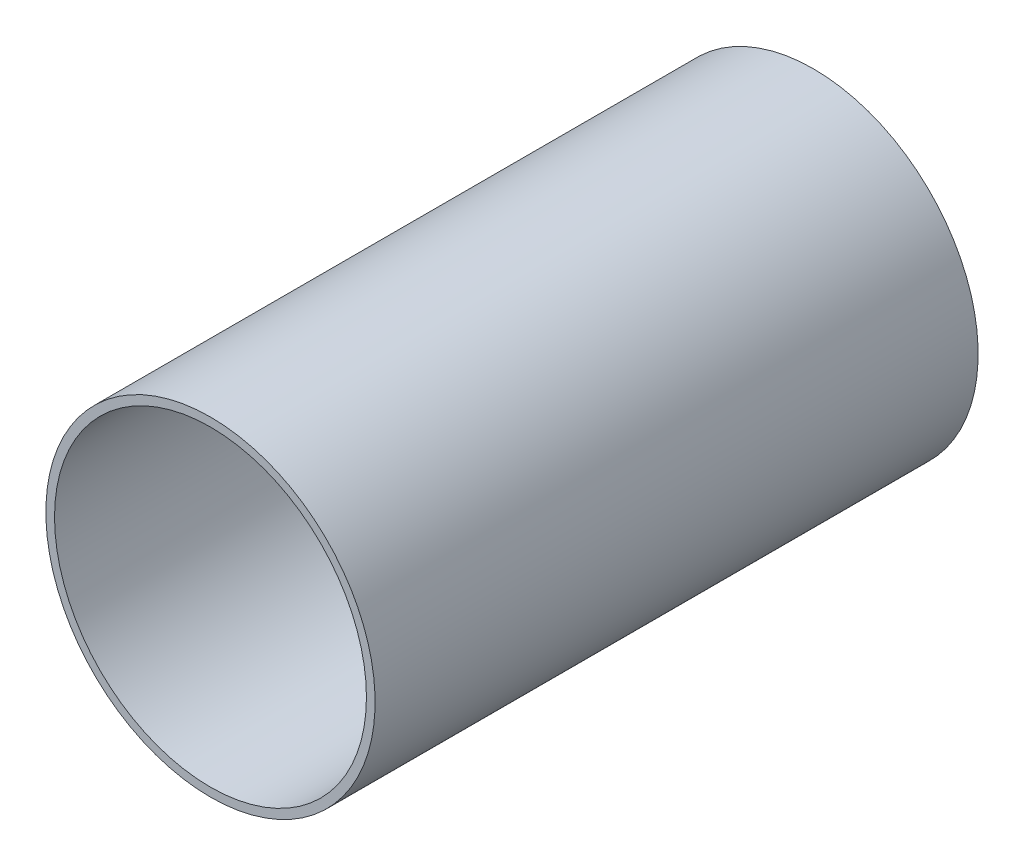
ISO-10303-21;
HEADER;
FILE_DESCRIPTION(('STEP AP214'),'2;1');
FILE_NAME('part.step','',(''),(''),'','','');
FILE_SCHEMA(('AUTOMOTIVE_DESIGN { 1 0 10303 214 1 1 1 1 }'));
ENDSEC;
DATA;
#1=APPLICATION_CONTEXT('core data for automotive mechanical design processes');
#2=APPLICATION_PROTOCOL_DEFINITION('international standard','automotive_design',2000,#1);
#3=PRODUCT_CONTEXT('',#1,'mechanical');
#4=PRODUCT('Part','Part','',(#3));
#5=PRODUCT_RELATED_PRODUCT_CATEGORY('part','',(#4));
#6=PRODUCT_DEFINITION_FORMATION('','',#4);
#7=PRODUCT_DEFINITION_CONTEXT('part definition',#1,'design');
#8=PRODUCT_DEFINITION('design','',#6,#7);
#9=PRODUCT_DEFINITION_SHAPE('','',#8);
#10=(LENGTH_UNIT() NAMED_UNIT(*) SI_UNIT(.MILLI.,.METRE.));
#11=(NAMED_UNIT(*) PLANE_ANGLE_UNIT() SI_UNIT($,.RADIAN.));
#12=(NAMED_UNIT(*) SI_UNIT($,.STERADIAN.) SOLID_ANGLE_UNIT());
#13=UNCERTAINTY_MEASURE_WITH_UNIT(LENGTH_MEASURE(1.E-05),#10,'distance_accuracy_value','');
#14=(GEOMETRIC_REPRESENTATION_CONTEXT(3) GLOBAL_UNCERTAINTY_ASSIGNED_CONTEXT((#13)) GLOBAL_UNIT_ASSIGNED_CONTEXT((#10,
#11,#12)) REPRESENTATION_CONTEXT('',''));
#15=CARTESIAN_POINT('',(0.,0.,0.));
#16=DIRECTION('',(0.,0.,1.));
#17=DIRECTION('',(1.,0.,0.));
#18=AXIS2_PLACEMENT_3D('',#15,#16,#17);
#19=CARTESIAN_POINT('',(177.26,-131.956,-0.045));
#20=DIRECTION('',(0.,0.,-1.));
#21=DIRECTION('',(0.,-1.,0.));
#22=AXIS2_PLACEMENT_3D('',#19,#20,#21);
#23=CYLINDRICAL_SURFACE('',#22,0.45);
#24=CARTESIAN_POINT('',(177.26,-131.956,-0.035));
#25=DIRECTION('',(0.,0.,-1.));
#26=DIRECTION('',(0.,-1.,0.));
#27=AXIS2_PLACEMENT_3D('',#24,#25,#26);
#28=CIRCLE('',#27,0.45);
#29=CARTESIAN_POINT('',(177.26,-132.406,-0.035));
#30=VERTEX_POINT('',#29);
#31=EDGE_CURVE('E65',#30,#30,#28,.T.);
#32=ORIENTED_EDGE('',*,*,#31,.T.);
#33=DIRECTION('',(0.,0.,1.));
#34=VECTOR('',#33,1.);
#35=CARTESIAN_POINT('',(177.26,-132.406,-0.045));
#36=LINE('',#35,#34);
#37=CARTESIAN_POINT('',(177.26,-132.406,1.705));
#38=VERTEX_POINT('',#37);
#39=EDGE_CURVE('E11',#30,#38,#36,.T.);
#40=ORIENTED_EDGE('',*,*,#39,.T.);
#41=CARTESIAN_POINT('',(177.26,-131.956,1.705));
#42=DIRECTION('',(0.,0.,-1.));
#43=DIRECTION('',(0.,-1.,0.));
#44=AXIS2_PLACEMENT_3D('',#41,#42,#43);
#45=CIRCLE('',#44,0.45);
#46=EDGE_CURVE('E20',#38,#38,#45,.T.);
#47=ORIENTED_EDGE('',*,*,#46,.F.);
#48=ORIENTED_EDGE('',*,*,#39,.F.);
#49=EDGE_LOOP('',(#32,#40,#47,#48));
#50=FACE_BOUND('',#49,.T.);
#51=ADVANCED_FACE('F17',(#50),#23,.F.);
#52=CARTESIAN_POINT('',(177.26,-132.431,1.705));
#53=DIRECTION('',(0.,0.,1.));
#54=DIRECTION('',(1.,0.,0.));
#55=AXIS2_PLACEMENT_3D('',#52,#53,#54);
#56=PLANE('',#55);
#57=ORIENTED_EDGE('',*,*,#46,.T.);
#58=EDGE_LOOP('',(#57));
#59=FACE_BOUND('',#58,.T.);
#60=CARTESIAN_POINT('',(177.26,-131.956,1.705));
#61=DIRECTION('',(0.,0.,1.));
#62=DIRECTION('',(0.,-1.,0.));
#63=AXIS2_PLACEMENT_3D('',#60,#61,#62);
#64=CIRCLE('',#63,0.475);
#65=CARTESIAN_POINT('',(177.26,-132.431,1.705));
#66=VERTEX_POINT('',#65);
#67=EDGE_CURVE('E57',#66,#66,#64,.T.);
#68=ORIENTED_EDGE('',*,*,#67,.T.);
#69=EDGE_LOOP('',(#68));
#70=FACE_BOUND('',#69,.T.);
#71=ADVANCED_FACE('F76',(#59,#70),#56,.T.);
#72=CARTESIAN_POINT('',(177.26,-132.431,-0.035));
#73=DIRECTION('',(0.,0.,1.));
#74=DIRECTION('',(1.,0.,0.));
#75=AXIS2_PLACEMENT_3D('',#72,#73,#74);
#76=PLANE('',#75);
#77=ORIENTED_EDGE('',*,*,#31,.F.);
#78=EDGE_LOOP('',(#77));
#79=FACE_BOUND('',#78,.T.);
#80=CARTESIAN_POINT('',(177.26,-131.956,-0.035));
#81=DIRECTION('',(0.,0.,1.));
#82=DIRECTION('',(0.,-1.,0.));
#83=AXIS2_PLACEMENT_3D('',#80,#81,#82);
#84=CIRCLE('',#83,0.475);
#85=CARTESIAN_POINT('',(177.26,-132.431,-0.035));
#86=VERTEX_POINT('',#85);
#87=EDGE_CURVE('E56',#86,#86,#84,.T.);
#88=ORIENTED_EDGE('',*,*,#87,.F.);
#89=EDGE_LOOP('',(#88));
#90=FACE_BOUND('',#89,.T.);
#91=ADVANCED_FACE('F84',(#79,#90),#76,.F.);
#92=CARTESIAN_POINT('',(177.26,-131.956,-0.035));
#93=DIRECTION('',(0.,0.,-1.));
#94=DIRECTION('',(0.,-1.,0.));
#95=AXIS2_PLACEMENT_3D('',#92,#93,#94);
#96=CYLINDRICAL_SURFACE('',#95,0.475);
#97=ORIENTED_EDGE('',*,*,#87,.T.);
#98=DIRECTION('',(0.,0.,1.));
#99=VECTOR('',#98,1.);
#100=CARTESIAN_POINT('',(177.26,-132.431,-0.035));
#101=LINE('',#100,#99);
#102=EDGE_CURVE('E53',#86,#66,#101,.T.);
#103=ORIENTED_EDGE('',*,*,#102,.T.);
#104=ORIENTED_EDGE('',*,*,#67,.F.);
#105=ORIENTED_EDGE('',*,*,#102,.F.);
#106=EDGE_LOOP('',(#97,#103,#104,#105));
#107=FACE_BOUND('',#106,.T.);
#108=ADVANCED_FACE('F54',(#107),#96,.T.);
#109=CLOSED_SHELL('',(#51,#71,#91,#108));
#110=MANIFOLD_SOLID_BREP('B1',#109);
#111=ADVANCED_BREP_SHAPE_REPRESENTATION('',(#18,#110),#14);
#112=SHAPE_DEFINITION_REPRESENTATION(#9,#111);
ENDSEC;
END-ISO-10303-21;
